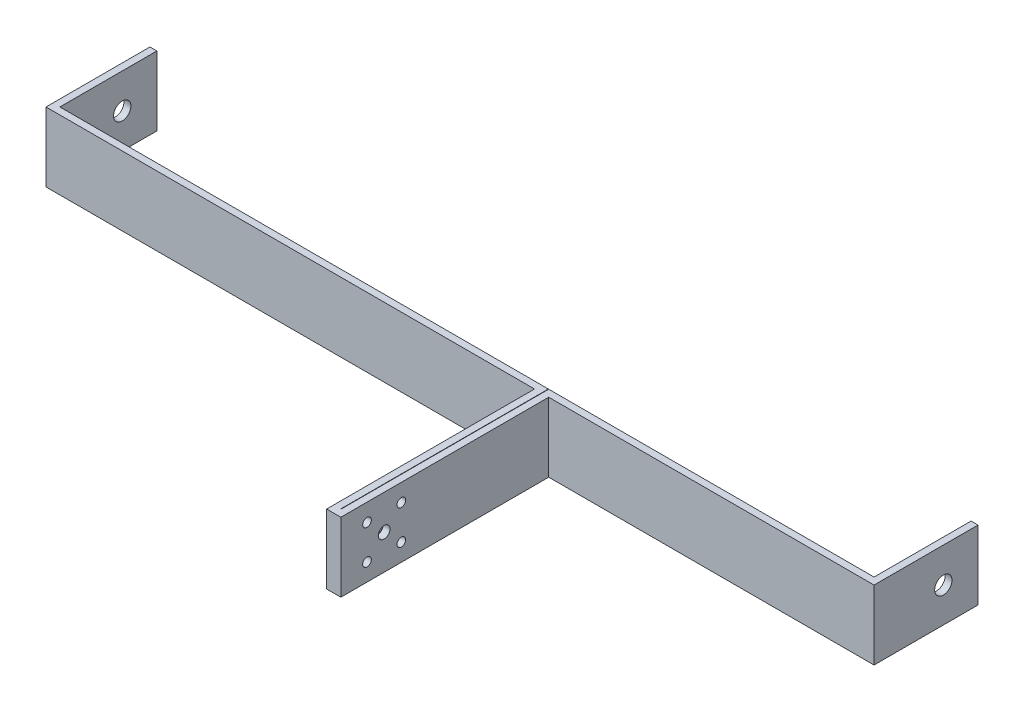
ISO-10303-21;
HEADER;
FILE_DESCRIPTION(('STEP AP214'),'2;1');
FILE_NAME('part.step','',(''),(''),'','','');
FILE_SCHEMA(('AUTOMOTIVE_DESIGN { 1 0 10303 214 1 1 1 1 }'));
ENDSEC;
DATA;
#1=APPLICATION_CONTEXT('core data for automotive mechanical design processes');
#2=APPLICATION_PROTOCOL_DEFINITION('international standard','automotive_design',2000,#1);
#3=PRODUCT_CONTEXT('',#1,'mechanical');
#4=PRODUCT('Part','Part','',(#3));
#5=PRODUCT_RELATED_PRODUCT_CATEGORY('part','',(#4));
#6=PRODUCT_DEFINITION_FORMATION('','',#4);
#7=PRODUCT_DEFINITION_CONTEXT('part definition',#1,'design');
#8=PRODUCT_DEFINITION('design','',#6,#7);
#9=PRODUCT_DEFINITION_SHAPE('','',#8);
#10=(LENGTH_UNIT() NAMED_UNIT(*) SI_UNIT(.MILLI.,.METRE.));
#11=(NAMED_UNIT(*) PLANE_ANGLE_UNIT() SI_UNIT($,.RADIAN.));
#12=(NAMED_UNIT(*) SI_UNIT($,.STERADIAN.) SOLID_ANGLE_UNIT());
#13=UNCERTAINTY_MEASURE_WITH_UNIT(LENGTH_MEASURE(1.E-05),#10,'distance_accuracy_value','');
#14=(GEOMETRIC_REPRESENTATION_CONTEXT(3) GLOBAL_UNCERTAINTY_ASSIGNED_CONTEXT((#13)) GLOBAL_UNIT_ASSIGNED_CONTEXT((#10,
#11,#12)) REPRESENTATION_CONTEXT('',''));
#15=CARTESIAN_POINT('',(0.,0.,0.));
#16=DIRECTION('',(0.,0.,1.));
#17=DIRECTION('',(1.,0.,0.));
#18=AXIS2_PLACEMENT_3D('',#15,#16,#17);
#19=CARTESIAN_POINT('',(0.,-10.,18.));
#20=DIRECTION('',(0.,0.,1.));
#21=DIRECTION('',(1.,0.,0.));
#22=AXIS2_PLACEMENT_3D('',#19,#20,#21);
#23=PLANE('',#22);
#24=DIRECTION('',(0.,1.,0.));
#25=VECTOR('',#24,1.);
#26=CARTESIAN_POINT('',(23.6,-10.,18.));
#27=LINE('',#26,#25);
#28=CARTESIAN_POINT('',(23.6,-10.,18.));
#29=VERTEX_POINT('',#28);
#30=CARTESIAN_POINT('',(23.6,10.,18.));
#31=VERTEX_POINT('',#30);
#32=EDGE_CURVE('E151',#29,#31,#27,.T.);
#33=ORIENTED_EDGE('',*,*,#32,.T.);
#34=DIRECTION('',(1.,0.,0.));
#35=VECTOR('',#34,1.);
#36=CARTESIAN_POINT('',(0.,10.,18.));
#37=LINE('',#36,#35);
#38=CARTESIAN_POINT('',(117.5,10.,18.));
#39=VERTEX_POINT('',#38);
#40=EDGE_CURVE('E154',#31,#39,#37,.T.);
#41=ORIENTED_EDGE('',*,*,#40,.T.);
#42=DIRECTION('',(0.,1.,0.));
#43=VECTOR('',#42,1.);
#44=CARTESIAN_POINT('',(117.5,-10.,18.));
#45=LINE('',#44,#43);
#46=CARTESIAN_POINT('',(117.5,-10.,18.));
#47=VERTEX_POINT('',#46);
#48=EDGE_CURVE('E11',#47,#39,#45,.T.);
#49=ORIENTED_EDGE('',*,*,#48,.F.);
#50=DIRECTION('',(1.,0.,0.));
#51=VECTOR('',#50,1.);
#52=CARTESIAN_POINT('',(0.,-10.,18.));
#53=LINE('',#52,#51);
#54=EDGE_CURVE('E156',#29,#47,#53,.T.);
#55=ORIENTED_EDGE('',*,*,#54,.F.);
#56=EDGE_LOOP('',(#33,#41,#49,#55));
#57=FACE_BOUND('',#56,.T.);
#58=ADVANCED_FACE('F40',(#57),#23,.F.);
#59=CARTESIAN_POINT('',(117.5,-10.,0.));
#60=DIRECTION('',(1.,0.,0.));
#61=DIRECTION('',(0.,0.,-1.));
#62=AXIS2_PLACEMENT_3D('',#59,#60,#61);
#63=PLANE('',#62);
#64=CARTESIAN_POINT('',(117.5,0.,0.));
#65=DIRECTION('',(1.,0.,0.));
#66=DIRECTION('',(0.,0.,-1.));
#67=AXIS2_PLACEMENT_3D('',#64,#65,#66);
#68=CIRCLE('',#67,2.5);
#69=CARTESIAN_POINT('',(117.5,0.,-2.5));
#70=VERTEX_POINT('',#69);
#71=EDGE_CURVE('E171',#70,#70,#68,.T.);
#72=ORIENTED_EDGE('',*,*,#71,.T.);
#73=EDGE_LOOP('',(#72));
#74=FACE_BOUND('',#73,.T.);
#75=ORIENTED_EDGE('',*,*,#48,.T.);
#76=DIRECTION('',(0.,0.,-1.));
#77=VECTOR('',#76,1.);
#78=CARTESIAN_POINT('',(117.5,10.,0.));
#79=LINE('',#78,#77);
#80=CARTESIAN_POINT('',(117.5,10.,-10.));
#81=VERTEX_POINT('',#80);
#82=EDGE_CURVE('E170',#39,#81,#79,.T.);
#83=ORIENTED_EDGE('',*,*,#82,.T.);
#84=DIRECTION('',(0.,1.,0.));
#85=VECTOR('',#84,1.);
#86=CARTESIAN_POINT('',(117.5,-10.,-10.));
#87=LINE('',#86,#85);
#88=CARTESIAN_POINT('',(117.5,-10.,-10.));
#89=VERTEX_POINT('',#88);
#90=EDGE_CURVE('E48',#89,#81,#87,.T.);
#91=ORIENTED_EDGE('',*,*,#90,.F.);
#92=DIRECTION('',(0.,0.,-1.));
#93=VECTOR('',#92,1.);
#94=CARTESIAN_POINT('',(117.5,-10.,0.));
#95=LINE('',#94,#93);
#96=EDGE_CURVE('E55',#47,#89,#95,.T.);
#97=ORIENTED_EDGE('',*,*,#96,.F.);
#98=EDGE_LOOP('',(#75,#83,#91,#97));
#99=FACE_BOUND('',#98,.T.);
#100=ADVANCED_FACE('F331',(#74,#99),#63,.F.);
#101=CARTESIAN_POINT('',(0.,-10.,-10.0000000000001));
#102=DIRECTION('',(0.,0.,1.));
#103=DIRECTION('',(1.,0.,0.));
#104=AXIS2_PLACEMENT_3D('',#101,#102,#103);
#105=PLANE('',#104);
#106=ORIENTED_EDGE('',*,*,#90,.T.);
#107=DIRECTION('',(1.,0.,0.));
#108=VECTOR('',#107,1.);
#109=CARTESIAN_POINT('',(0.,10.,-10.0000000000001));
#110=LINE('',#109,#108);
#111=CARTESIAN_POINT('',(119.5,10.,-10.));
#112=VERTEX_POINT('',#111);
#113=EDGE_CURVE('E213',#81,#112,#110,.T.);
#114=ORIENTED_EDGE('',*,*,#113,.T.);
#115=DIRECTION('',(0.,1.,0.));
#116=VECTOR('',#115,1.);
#117=CARTESIAN_POINT('',(119.5,-10.,-10.));
#118=LINE('',#117,#116);
#119=CARTESIAN_POINT('',(119.5,-10.,-10.));
#120=VERTEX_POINT('',#119);
#121=EDGE_CURVE('E256',#120,#112,#118,.T.);
#122=ORIENTED_EDGE('',*,*,#121,.F.);
#123=DIRECTION('',(1.,0.,0.));
#124=VECTOR('',#123,1.);
#125=CARTESIAN_POINT('',(0.,-10.,-10.0000000000001));
#126=LINE('',#125,#124);
#127=EDGE_CURVE('E252',#89,#120,#126,.T.);
#128=ORIENTED_EDGE('',*,*,#127,.F.);
#129=EDGE_LOOP('',(#106,#114,#122,#128));
#130=FACE_BOUND('',#129,.T.);
#131=ADVANCED_FACE('F354',(#130),#105,.F.);
#132=CARTESIAN_POINT('',(119.5,-10.,0.));
#133=DIRECTION('',(-1.,0.,0.));
#134=DIRECTION('',(0.,0.,1.));
#135=AXIS2_PLACEMENT_3D('',#132,#133,#134);
#136=PLANE('',#135);
#137=CARTESIAN_POINT('',(119.5,0.,0.));
#138=DIRECTION('',(-1.,0.,0.));
#139=DIRECTION('',(0.,0.,1.));
#140=AXIS2_PLACEMENT_3D('',#137,#138,#139);
#141=CIRCLE('',#140,2.5);
#142=CARTESIAN_POINT('',(119.5,0.,2.5));
#143=VERTEX_POINT('',#142);
#144=EDGE_CURVE('E284',#143,#143,#141,.T.);
#145=ORIENTED_EDGE('',*,*,#144,.T.);
#146=EDGE_LOOP('',(#145));
#147=FACE_BOUND('',#146,.T.);
#148=ORIENTED_EDGE('',*,*,#121,.T.);
#149=DIRECTION('',(0.,0.,1.));
#150=VECTOR('',#149,1.);
#151=CARTESIAN_POINT('',(119.5,10.,0.));
#152=LINE('',#151,#150);
#153=CARTESIAN_POINT('',(119.5,10.,20.));
#154=VERTEX_POINT('',#153);
#155=EDGE_CURVE('E210',#112,#154,#152,.T.);
#156=ORIENTED_EDGE('',*,*,#155,.T.);
#157=DIRECTION('',(0.,1.,0.));
#158=VECTOR('',#157,1.);
#159=CARTESIAN_POINT('',(119.5,-10.,20.));
#160=LINE('',#159,#158);
#161=CARTESIAN_POINT('',(119.5,-10.,20.));
#162=VERTEX_POINT('',#161);
#163=EDGE_CURVE('E258',#162,#154,#160,.T.);
#164=ORIENTED_EDGE('',*,*,#163,.F.);
#165=DIRECTION('',(0.,0.,1.));
#166=VECTOR('',#165,1.);
#167=CARTESIAN_POINT('',(119.5,-10.,0.));
#168=LINE('',#167,#166);
#169=EDGE_CURVE('E250',#120,#162,#168,.T.);
#170=ORIENTED_EDGE('',*,*,#169,.F.);
#171=EDGE_LOOP('',(#148,#156,#164,#170));
#172=FACE_BOUND('',#171,.T.);
#173=ADVANCED_FACE('F359',(#147,#172),#136,.F.);
#174=CARTESIAN_POINT('',(0.,-10.,20.));
#175=DIRECTION('',(0.,0.,1.));
#176=DIRECTION('',(1.,0.,0.));
#177=AXIS2_PLACEMENT_3D('',#174,#175,#176);
#178=PLANE('',#177);
#179=ORIENTED_EDGE('',*,*,#163,.T.);
#180=DIRECTION('',(1.,0.,0.));
#181=VECTOR('',#180,1.);
#182=CARTESIAN_POINT('',(0.,10.,20.));
#183=LINE('',#182,#181);
#184=CARTESIAN_POINT('',(25.6,10.,20.));
#185=VERTEX_POINT('',#184);
#186=EDGE_CURVE('E207',#185,#154,#183,.T.);
#187=ORIENTED_EDGE('',*,*,#186,.F.);
#188=DIRECTION('',(0.,1.,0.));
#189=VECTOR('',#188,1.);
#190=CARTESIAN_POINT('',(25.6,-10.,20.));
#191=LINE('',#190,#189);
#192=CARTESIAN_POINT('',(25.6,-10.,20.));
#193=VERTEX_POINT('',#192);
#194=EDGE_CURVE('E260',#193,#185,#191,.T.);
#195=ORIENTED_EDGE('',*,*,#194,.F.);
#196=DIRECTION('',(1.,0.,0.));
#197=VECTOR('',#196,1.);
#198=CARTESIAN_POINT('',(0.,-10.,20.));
#199=LINE('',#198,#197);
#200=EDGE_CURVE('E247',#193,#162,#199,.T.);
#201=ORIENTED_EDGE('',*,*,#200,.T.);
#202=EDGE_LOOP('',(#179,#187,#195,#201));
#203=FACE_BOUND('',#202,.T.);
#204=ADVANCED_FACE('F367',(#203),#178,.T.);
#205=CARTESIAN_POINT('',(25.6,-10.,0.));
#206=DIRECTION('',(1.,0.,0.));
#207=DIRECTION('',(0.,0.,-1.));
#208=AXIS2_PLACEMENT_3D('',#205,#206,#207);
#209=PLANE('',#208);
#210=CARTESIAN_POINT('',(25.6,-4.94974746830583,62.5502525316942));
#211=DIRECTION('',(1.,0.,0.));
#212=DIRECTION('',(0.,0.,-1.));
#213=AXIS2_PLACEMENT_3D('',#210,#211,#212);
#214=CIRCLE('',#213,1.25);
#215=CARTESIAN_POINT('',(25.6,-4.94974746830583,61.3002525316942));
#216=VERTEX_POINT('',#215);
#217=EDGE_CURVE('E463',#216,#216,#214,.T.);
#218=ORIENTED_EDGE('',*,*,#217,.F.);
#219=EDGE_LOOP('',(#218));
#220=FACE_BOUND('',#219,.T.);
#221=CARTESIAN_POINT('',(25.6,4.94974746830583,62.5502525316942));
#222=DIRECTION('',(1.,0.,0.));
#223=DIRECTION('',(0.,0.,-1.));
#224=AXIS2_PLACEMENT_3D('',#221,#222,#223);
#225=CIRCLE('',#224,1.25);
#226=CARTESIAN_POINT('',(25.6,4.94974746830583,61.3002525316942));
#227=VERTEX_POINT('',#226);
#228=EDGE_CURVE('E466',#227,#227,#225,.T.);
#229=ORIENTED_EDGE('',*,*,#228,.F.);
#230=EDGE_LOOP('',(#229));
#231=FACE_BOUND('',#230,.T.);
#232=CARTESIAN_POINT('',(25.6,4.94974746830583,72.4497474683058));
#233=DIRECTION('',(1.,0.,0.));
#234=DIRECTION('',(0.,0.,-1.));
#235=AXIS2_PLACEMENT_3D('',#232,#233,#234);
#236=CIRCLE('',#235,1.25);
#237=CARTESIAN_POINT('',(25.6,4.94974746830583,71.1997474683058));
#238=VERTEX_POINT('',#237);
#239=EDGE_CURVE('E469',#238,#238,#236,.T.);
#240=ORIENTED_EDGE('',*,*,#239,.F.);
#241=EDGE_LOOP('',(#240));
#242=FACE_BOUND('',#241,.T.);
#243=CARTESIAN_POINT('',(25.6,-4.94974746830583,72.4497474683058));
#244=DIRECTION('',(1.,0.,0.));
#245=DIRECTION('',(0.,0.,-1.));
#246=AXIS2_PLACEMENT_3D('',#243,#244,#245);
#247=CIRCLE('',#246,1.25);
#248=CARTESIAN_POINT('',(25.6,-4.94974746830583,71.1997474683058));
#249=VERTEX_POINT('',#248);
#250=EDGE_CURVE('E462',#249,#249,#247,.T.);
#251=ORIENTED_EDGE('',*,*,#250,.F.);
#252=EDGE_LOOP('',(#251));
#253=FACE_BOUND('',#252,.T.);
#254=CARTESIAN_POINT('',(25.6,0.,67.5));
#255=DIRECTION('',(1.,0.,0.));
#256=DIRECTION('',(0.,0.,-1.));
#257=AXIS2_PLACEMENT_3D('',#254,#255,#256);
#258=CIRCLE('',#257,1.7);
#259=CARTESIAN_POINT('',(25.6,0.,65.8));
#260=VERTEX_POINT('',#259);
#261=EDGE_CURVE('E290',#260,#260,#258,.T.);
#262=ORIENTED_EDGE('',*,*,#261,.F.);
#263=EDGE_LOOP('',(#262));
#264=FACE_BOUND('',#263,.T.);
#265=ORIENTED_EDGE('',*,*,#194,.T.);
#266=DIRECTION('',(0.,0.,-1.));
#267=VECTOR('',#266,1.);
#268=CARTESIAN_POINT('',(25.6,10.,0.));
#269=LINE('',#268,#267);
#270=CARTESIAN_POINT('',(25.6,10.,80.));
#271=VERTEX_POINT('',#270);
#272=EDGE_CURVE('E204',#271,#185,#269,.T.);
#273=ORIENTED_EDGE('',*,*,#272,.F.);
#274=DIRECTION('',(0.,1.,0.));
#275=VECTOR('',#274,1.);
#276=CARTESIAN_POINT('',(25.6,-10.,80.));
#277=LINE('',#276,#275);
#278=CARTESIAN_POINT('',(25.6,-10.,80.));
#279=VERTEX_POINT('',#278);
#280=EDGE_CURVE('E262',#279,#271,#277,.T.);
#281=ORIENTED_EDGE('',*,*,#280,.F.);
#282=DIRECTION('',(0.,0.,-1.));
#283=VECTOR('',#282,1.);
#284=CARTESIAN_POINT('',(25.6,-10.,0.));
#285=LINE('',#284,#283);
#286=EDGE_CURVE('E244',#279,#193,#285,.T.);
#287=ORIENTED_EDGE('',*,*,#286,.T.);
#288=EDGE_LOOP('',(#265,#273,#281,#287));
#289=FACE_BOUND('',#288,.T.);
#290=ADVANCED_FACE('F371',(#220,#231,#242,#253,#264,#289),#209,.T.);
#291=CARTESIAN_POINT('',(0.,-10.,80.));
#292=DIRECTION('',(0.,0.,1.));
#293=DIRECTION('',(1.,0.,0.));
#294=AXIS2_PLACEMENT_3D('',#291,#292,#293);
#295=PLANE('',#294);
#296=ORIENTED_EDGE('',*,*,#280,.T.);
#297=DIRECTION('',(1.,0.,0.));
#298=VECTOR('',#297,1.);
#299=CARTESIAN_POINT('',(0.,10.,80.));
#300=LINE('',#299,#298);
#301=CARTESIAN_POINT('',(21.5,10.,80.));
#302=VERTEX_POINT('',#301);
#303=EDGE_CURVE('E201',#302,#271,#300,.T.);
#304=ORIENTED_EDGE('',*,*,#303,.F.);
#305=DIRECTION('',(0.,1.,0.));
#306=VECTOR('',#305,1.);
#307=CARTESIAN_POINT('',(21.5,-10.,80.));
#308=LINE('',#307,#306);
#309=CARTESIAN_POINT('',(21.5,-10.,80.));
#310=VERTEX_POINT('',#309);
#311=EDGE_CURVE('E264',#310,#302,#308,.T.);
#312=ORIENTED_EDGE('',*,*,#311,.F.);
#313=DIRECTION('',(1.,0.,0.));
#314=VECTOR('',#313,1.);
#315=CARTESIAN_POINT('',(0.,-10.,80.));
#316=LINE('',#315,#314);
#317=EDGE_CURVE('E241',#310,#279,#316,.T.);
#318=ORIENTED_EDGE('',*,*,#317,.T.);
#319=EDGE_LOOP('',(#296,#304,#312,#318));
#320=FACE_BOUND('',#319,.T.);
#321=ADVANCED_FACE('F375',(#320),#295,.T.);
#322=CARTESIAN_POINT('',(21.5,-10.,0.));
#323=DIRECTION('',(-1.,0.,0.));
#324=DIRECTION('',(0.,0.,1.));
#325=AXIS2_PLACEMENT_3D('',#322,#323,#324);
#326=PLANE('',#325);
#327=CARTESIAN_POINT('',(21.5,-4.94974746830583,62.5502525316942));
#328=DIRECTION('',(-1.,0.,0.));
#329=DIRECTION('',(0.,0.,1.));
#330=AXIS2_PLACEMENT_3D('',#327,#328,#329);
#331=CIRCLE('',#330,1.25);
#332=CARTESIAN_POINT('',(21.5,-4.94974746830583,63.8002525316942));
#333=VERTEX_POINT('',#332);
#334=EDGE_CURVE('E322',#333,#333,#331,.T.);
#335=ORIENTED_EDGE('',*,*,#334,.F.);
#336=EDGE_LOOP('',(#335));
#337=FACE_BOUND('',#336,.T.);
#338=CARTESIAN_POINT('',(21.5,4.94974746830583,62.5502525316942));
#339=DIRECTION('',(-1.,0.,0.));
#340=DIRECTION('',(0.,0.,1.));
#341=AXIS2_PLACEMENT_3D('',#338,#339,#340);
#342=CIRCLE('',#341,1.25);
#343=CARTESIAN_POINT('',(21.5,4.94974746830583,63.8002525316942));
#344=VERTEX_POINT('',#343);
#345=EDGE_CURVE('E307',#344,#344,#342,.T.);
#346=ORIENTED_EDGE('',*,*,#345,.F.);
#347=EDGE_LOOP('',(#346));
#348=FACE_BOUND('',#347,.T.);
#349=CARTESIAN_POINT('',(21.5,4.94974746830583,72.4497474683058));
#350=DIRECTION('',(-1.,0.,0.));
#351=DIRECTION('',(0.,0.,1.));
#352=AXIS2_PLACEMENT_3D('',#349,#350,#351);
#353=CIRCLE('',#352,1.25);
#354=CARTESIAN_POINT('',(21.5,4.94974746830583,73.6997474683058));
#355=VERTEX_POINT('',#354);
#356=EDGE_CURVE('E303',#355,#355,#353,.T.);
#357=ORIENTED_EDGE('',*,*,#356,.F.);
#358=EDGE_LOOP('',(#357));
#359=FACE_BOUND('',#358,.T.);
#360=CARTESIAN_POINT('',(21.5,-4.94974746830583,72.4497474683058));
#361=DIRECTION('',(-1.,0.,0.));
#362=DIRECTION('',(0.,0.,1.));
#363=AXIS2_PLACEMENT_3D('',#360,#361,#362);
#364=CIRCLE('',#363,1.25);
#365=CARTESIAN_POINT('',(21.5,-4.94974746830583,73.6997474683058));
#366=VERTEX_POINT('',#365);
#367=EDGE_CURVE('E299',#366,#366,#364,.T.);
#368=ORIENTED_EDGE('',*,*,#367,.F.);
#369=EDGE_LOOP('',(#368));
#370=FACE_BOUND('',#369,.T.);
#371=CARTESIAN_POINT('',(21.5,0.,67.5));
#372=DIRECTION('',(-1.,0.,0.));
#373=DIRECTION('',(0.,0.,1.));
#374=AXIS2_PLACEMENT_3D('',#371,#372,#373);
#375=CIRCLE('',#374,1.7);
#376=CARTESIAN_POINT('',(21.5,0.,69.2));
#377=VERTEX_POINT('',#376);
#378=EDGE_CURVE('E295',#377,#377,#375,.T.);
#379=ORIENTED_EDGE('',*,*,#378,.F.);
#380=EDGE_LOOP('',(#379));
#381=FACE_BOUND('',#380,.T.);
#382=ORIENTED_EDGE('',*,*,#311,.T.);
#383=DIRECTION('',(0.,0.,1.));
#384=VECTOR('',#383,1.);
#385=CARTESIAN_POINT('',(21.5,10.,0.));
#386=LINE('',#385,#384);
#387=CARTESIAN_POINT('',(21.5,10.,20.));
#388=VERTEX_POINT('',#387);
#389=EDGE_CURVE('E198',#388,#302,#386,.T.);
#390=ORIENTED_EDGE('',*,*,#389,.F.);
#391=DIRECTION('',(0.,1.,0.));
#392=VECTOR('',#391,1.);
#393=CARTESIAN_POINT('',(21.5,-10.,20.));
#394=LINE('',#393,#392);
#395=CARTESIAN_POINT('',(21.5,-10.,20.));
#396=VERTEX_POINT('',#395);
#397=EDGE_CURVE('E266',#396,#388,#394,.T.);
#398=ORIENTED_EDGE('',*,*,#397,.F.);
#399=DIRECTION('',(0.,0.,1.));
#400=VECTOR('',#399,1.);
#401=CARTESIAN_POINT('',(21.5,-10.,0.));
#402=LINE('',#401,#400);
#403=EDGE_CURVE('E238',#396,#310,#402,.T.);
#404=ORIENTED_EDGE('',*,*,#403,.T.);
#405=EDGE_LOOP('',(#382,#390,#398,#404));
#406=FACE_BOUND('',#405,.T.);
#407=ADVANCED_FACE('F379',(#337,#348,#359,#370,#381,#406),#326,.T.);
#408=CARTESIAN_POINT('',(0.,-10.,20.));
#409=DIRECTION('',(0.,0.,1.));
#410=DIRECTION('',(1.,0.,0.));
#411=AXIS2_PLACEMENT_3D('',#408,#409,#410);
#412=PLANE('',#411);
#413=ORIENTED_EDGE('',*,*,#397,.T.);
#414=DIRECTION('',(1.,0.,0.));
#415=VECTOR('',#414,1.);
#416=CARTESIAN_POINT('',(0.,10.,20.));
#417=LINE('',#416,#415);
#418=CARTESIAN_POINT('',(-119.5,10.,20.));
#419=VERTEX_POINT('',#418);
#420=EDGE_CURVE('E195',#419,#388,#417,.T.);
#421=ORIENTED_EDGE('',*,*,#420,.F.);
#422=DIRECTION('',(0.,1.,0.));
#423=VECTOR('',#422,1.);
#424=CARTESIAN_POINT('',(-119.5,-10.,20.));
#425=LINE('',#424,#423);
#426=CARTESIAN_POINT('',(-119.5,-10.,20.));
#427=VERTEX_POINT('',#426);
#428=EDGE_CURVE('E268',#427,#419,#425,.T.);
#429=ORIENTED_EDGE('',*,*,#428,.F.);
#430=DIRECTION('',(1.,0.,0.));
#431=VECTOR('',#430,1.);
#432=CARTESIAN_POINT('',(0.,-10.,20.));
#433=LINE('',#432,#431);
#434=EDGE_CURVE('E235',#427,#396,#433,.T.);
#435=ORIENTED_EDGE('',*,*,#434,.T.);
#436=EDGE_LOOP('',(#413,#421,#429,#435));
#437=FACE_BOUND('',#436,.T.);
#438=ADVANCED_FACE('F383',(#437),#412,.T.);
#439=CARTESIAN_POINT('',(-119.5,-10.,0.));
#440=DIRECTION('',(-1.,0.,0.));
#441=DIRECTION('',(0.,0.,1.));
#442=AXIS2_PLACEMENT_3D('',#439,#440,#441);
#443=PLANE('',#442);
#444=CARTESIAN_POINT('',(-119.5,0.,0.));
#445=DIRECTION('',(-1.,0.,0.));
#446=DIRECTION('',(0.,0.,1.));
#447=AXIS2_PLACEMENT_3D('',#444,#445,#446);
#448=CIRCLE('',#447,2.5);
#449=CARTESIAN_POINT('',(-119.5,0.,2.5));
#450=VERTEX_POINT('',#449);
#451=EDGE_CURVE('E285',#450,#450,#448,.T.);
#452=ORIENTED_EDGE('',*,*,#451,.F.);
#453=EDGE_LOOP('',(#452));
#454=FACE_BOUND('',#453,.T.);
#455=ORIENTED_EDGE('',*,*,#428,.T.);
#456=DIRECTION('',(0.,0.,1.));
#457=VECTOR('',#456,1.);
#458=CARTESIAN_POINT('',(-119.5,10.,0.));
#459=LINE('',#458,#457);
#460=CARTESIAN_POINT('',(-119.5,10.,-10.));
#461=VERTEX_POINT('',#460);
#462=EDGE_CURVE('E192',#461,#419,#459,.T.);
#463=ORIENTED_EDGE('',*,*,#462,.F.);
#464=DIRECTION('',(0.,1.,0.));
#465=VECTOR('',#464,1.);
#466=CARTESIAN_POINT('',(-119.5,-10.,-10.));
#467=LINE('',#466,#465);
#468=CARTESIAN_POINT('',(-119.5,-10.,-10.));
#469=VERTEX_POINT('',#468);
#470=EDGE_CURVE('E270',#469,#461,#467,.T.);
#471=ORIENTED_EDGE('',*,*,#470,.F.);
#472=DIRECTION('',(0.,0.,1.));
#473=VECTOR('',#472,1.);
#474=CARTESIAN_POINT('',(-119.5,-10.,0.));
#475=LINE('',#474,#473);
#476=EDGE_CURVE('E232',#469,#427,#475,.T.);
#477=ORIENTED_EDGE('',*,*,#476,.T.);
#478=EDGE_LOOP('',(#455,#463,#471,#477));
#479=FACE_BOUND('',#478,.T.);
#480=ADVANCED_FACE('F387',(#454,#479),#443,.T.);
#481=CARTESIAN_POINT('',(0.,-10.,-10.0000000000001));
#482=DIRECTION('',(0.,0.,-1.));
#483=DIRECTION('',(-1.,0.,0.));
#484=AXIS2_PLACEMENT_3D('',#481,#482,#483);
#485=PLANE('',#484);
#486=ORIENTED_EDGE('',*,*,#470,.T.);
#487=DIRECTION('',(-1.,0.,0.));
#488=VECTOR('',#487,1.);
#489=CARTESIAN_POINT('',(0.,10.,-10.0000000000001));
#490=LINE('',#489,#488);
#491=CARTESIAN_POINT('',(-117.5,10.,-10.));
#492=VERTEX_POINT('',#491);
#493=EDGE_CURVE('E189',#492,#461,#490,.T.);
#494=ORIENTED_EDGE('',*,*,#493,.F.);
#495=DIRECTION('',(0.,1.,0.));
#496=VECTOR('',#495,1.);
#497=CARTESIAN_POINT('',(-117.5,-10.,-10.));
#498=LINE('',#497,#496);
#499=CARTESIAN_POINT('',(-117.5,-10.,-10.));
#500=VERTEX_POINT('',#499);
#501=EDGE_CURVE('E272',#500,#492,#498,.T.);
#502=ORIENTED_EDGE('',*,*,#501,.F.);
#503=DIRECTION('',(-1.,0.,0.));
#504=VECTOR('',#503,1.);
#505=CARTESIAN_POINT('',(0.,-10.,-10.0000000000001));
#506=LINE('',#505,#504);
#507=EDGE_CURVE('E229',#500,#469,#506,.T.);
#508=ORIENTED_EDGE('',*,*,#507,.T.);
#509=EDGE_LOOP('',(#486,#494,#502,#508));
#510=FACE_BOUND('',#509,.T.);
#511=ADVANCED_FACE('F391',(#510),#485,.T.);
#512=CARTESIAN_POINT('',(-117.5,-10.,0.));
#513=DIRECTION('',(1.,0.,0.));
#514=DIRECTION('',(0.,0.,-1.));
#515=AXIS2_PLACEMENT_3D('',#512,#513,#514);
#516=PLANE('',#515);
#517=CARTESIAN_POINT('',(-117.5,0.,0.));
#518=DIRECTION('',(1.,0.,0.));
#519=DIRECTION('',(0.,0.,-1.));
#520=AXIS2_PLACEMENT_3D('',#517,#518,#519);
#521=CIRCLE('',#520,2.5);
#522=CARTESIAN_POINT('',(-117.5,0.,-2.5));
#523=VERTEX_POINT('',#522);
#524=EDGE_CURVE('E281',#523,#523,#521,.T.);
#525=ORIENTED_EDGE('',*,*,#524,.F.);
#526=EDGE_LOOP('',(#525));
#527=FACE_BOUND('',#526,.T.);
#528=ORIENTED_EDGE('',*,*,#501,.T.);
#529=DIRECTION('',(0.,0.,-1.));
#530=VECTOR('',#529,1.);
#531=CARTESIAN_POINT('',(-117.5,10.,0.));
#532=LINE('',#531,#530);
#533=CARTESIAN_POINT('',(-117.5,10.,18.));
#534=VERTEX_POINT('',#533);
#535=EDGE_CURVE('E186',#534,#492,#532,.T.);
#536=ORIENTED_EDGE('',*,*,#535,.F.);
#537=DIRECTION('',(0.,1.,0.));
#538=VECTOR('',#537,1.);
#539=CARTESIAN_POINT('',(-117.5,-10.,18.));
#540=LINE('',#539,#538);
#541=CARTESIAN_POINT('',(-117.5,-10.,18.));
#542=VERTEX_POINT('',#541);
#543=EDGE_CURVE('E274',#542,#534,#540,.T.);
#544=ORIENTED_EDGE('',*,*,#543,.F.);
#545=DIRECTION('',(0.,0.,-1.));
#546=VECTOR('',#545,1.);
#547=CARTESIAN_POINT('',(-117.5,-10.,0.));
#548=LINE('',#547,#546);
#549=EDGE_CURVE('E226',#542,#500,#548,.T.);
#550=ORIENTED_EDGE('',*,*,#549,.T.);
#551=EDGE_LOOP('',(#528,#536,#544,#550));
#552=FACE_BOUND('',#551,.T.);
#553=ADVANCED_FACE('F395',(#527,#552),#516,.T.);
#554=CARTESIAN_POINT('',(0.,-10.,18.));
#555=DIRECTION('',(0.,0.,1.));
#556=DIRECTION('',(1.,0.,0.));
#557=AXIS2_PLACEMENT_3D('',#554,#555,#556);
#558=PLANE('',#557);
#559=ORIENTED_EDGE('',*,*,#543,.T.);
#560=DIRECTION('',(1.,0.,0.));
#561=VECTOR('',#560,1.);
#562=CARTESIAN_POINT('',(0.,10.,18.));
#563=LINE('',#562,#561);
#564=CARTESIAN_POINT('',(23.5,10.,18.));
#565=VERTEX_POINT('',#564);
#566=EDGE_CURVE('E183',#534,#565,#563,.T.);
#567=ORIENTED_EDGE('',*,*,#566,.T.);
#568=DIRECTION('',(0.,1.,0.));
#569=VECTOR('',#568,1.);
#570=CARTESIAN_POINT('',(23.5,-10.,18.));
#571=LINE('',#570,#569);
#572=CARTESIAN_POINT('',(23.5,-10.,18.));
#573=VERTEX_POINT('',#572);
#574=EDGE_CURVE('E276',#573,#565,#571,.T.);
#575=ORIENTED_EDGE('',*,*,#574,.F.);
#576=DIRECTION('',(1.,0.,0.));
#577=VECTOR('',#576,1.);
#578=CARTESIAN_POINT('',(0.,-10.,18.));
#579=LINE('',#578,#577);
#580=EDGE_CURVE('E224',#542,#573,#579,.T.);
#581=ORIENTED_EDGE('',*,*,#580,.F.);
#582=EDGE_LOOP('',(#559,#567,#575,#581));
#583=FACE_BOUND('',#582,.T.);
#584=ADVANCED_FACE('F399',(#583),#558,.F.);
#585=CARTESIAN_POINT('',(23.5,-10.,0.));
#586=DIRECTION('',(-1.,0.,0.));
#587=DIRECTION('',(0.,0.,1.));
#588=AXIS2_PLACEMENT_3D('',#585,#586,#587);
#589=PLANE('',#588);
#590=CARTESIAN_POINT('',(23.5,-4.94974746830583,62.5502525316942));
#591=DIRECTION('',(-1.,0.,0.));
#592=DIRECTION('',(0.,0.,1.));
#593=AXIS2_PLACEMENT_3D('',#590,#591,#592);
#594=CIRCLE('',#593,1.25);
#595=CARTESIAN_POINT('',(23.5,-4.94974746830583,63.8002525316942));
#596=VERTEX_POINT('',#595);
#597=EDGE_CURVE('E319',#596,#596,#594,.T.);
#598=ORIENTED_EDGE('',*,*,#597,.T.);
#599=EDGE_LOOP('',(#598));
#600=FACE_BOUND('',#599,.T.);
#601=CARTESIAN_POINT('',(23.5,4.94974746830583,62.5502525316942));
#602=DIRECTION('',(-1.,0.,0.));
#603=DIRECTION('',(0.,0.,1.));
#604=AXIS2_PLACEMENT_3D('',#601,#602,#603);
#605=CIRCLE('',#604,1.25);
#606=CARTESIAN_POINT('',(23.5,4.94974746830583,63.8002525316942));
#607=VERTEX_POINT('',#606);
#608=EDGE_CURVE('E302',#607,#607,#605,.T.);
#609=ORIENTED_EDGE('',*,*,#608,.T.);
#610=EDGE_LOOP('',(#609));
#611=FACE_BOUND('',#610,.T.);
#612=CARTESIAN_POINT('',(23.5,4.94974746830583,72.4497474683058));
#613=DIRECTION('',(-1.,0.,0.));
#614=DIRECTION('',(0.,0.,1.));
#615=AXIS2_PLACEMENT_3D('',#612,#613,#614);
#616=CIRCLE('',#615,1.25);
#617=CARTESIAN_POINT('',(23.5,4.94974746830583,73.6997474683058));
#618=VERTEX_POINT('',#617);
#619=EDGE_CURVE('E298',#618,#618,#616,.T.);
#620=ORIENTED_EDGE('',*,*,#619,.T.);
#621=EDGE_LOOP('',(#620));
#622=FACE_BOUND('',#621,.T.);
#623=CARTESIAN_POINT('',(23.5,-4.94974746830583,72.4497474683058));
#624=DIRECTION('',(-1.,0.,0.));
#625=DIRECTION('',(0.,0.,1.));
#626=AXIS2_PLACEMENT_3D('',#623,#624,#625);
#627=CIRCLE('',#626,1.25);
#628=CARTESIAN_POINT('',(23.5,-4.94974746830583,73.6997474683058));
#629=VERTEX_POINT('',#628);
#630=EDGE_CURVE('E294',#629,#629,#627,.T.);
#631=ORIENTED_EDGE('',*,*,#630,.T.);
#632=EDGE_LOOP('',(#631));
#633=FACE_BOUND('',#632,.T.);
#634=CARTESIAN_POINT('',(23.5,0.,67.5));
#635=DIRECTION('',(-1.,0.,0.));
#636=DIRECTION('',(0.,0.,1.));
#637=AXIS2_PLACEMENT_3D('',#634,#635,#636);
#638=CIRCLE('',#637,1.7);
#639=CARTESIAN_POINT('',(23.5,0.,69.2));
#640=VERTEX_POINT('',#639);
#641=EDGE_CURVE('E289',#640,#640,#638,.T.);
#642=ORIENTED_EDGE('',*,*,#641,.T.);
#643=EDGE_LOOP('',(#642));
#644=FACE_BOUND('',#643,.T.);
#645=ORIENTED_EDGE('',*,*,#574,.T.);
#646=DIRECTION('',(0.,0.,1.));
#647=VECTOR('',#646,1.);
#648=CARTESIAN_POINT('',(23.5,10.,0.));
#649=LINE('',#648,#647);
#650=CARTESIAN_POINT('',(23.5,10.,78.));
#651=VERTEX_POINT('',#650);
#652=EDGE_CURVE('E177',#565,#651,#649,.T.);
#653=ORIENTED_EDGE('',*,*,#652,.T.);
#654=DIRECTION('',(0.,1.,0.));
#655=VECTOR('',#654,1.);
#656=CARTESIAN_POINT('',(23.5,-10.,78.));
#657=LINE('',#656,#655);
#658=CARTESIAN_POINT('',(23.5,-10.,78.));
#659=VERTEX_POINT('',#658);
#660=EDGE_CURVE('E278',#659,#651,#657,.T.);
#661=ORIENTED_EDGE('',*,*,#660,.F.);
#662=DIRECTION('',(0.,0.,1.));
#663=VECTOR('',#662,1.);
#664=CARTESIAN_POINT('',(23.5,-10.,0.));
#665=LINE('',#664,#663);
#666=EDGE_CURVE('E222',#573,#659,#665,.T.);
#667=ORIENTED_EDGE('',*,*,#666,.F.);
#668=EDGE_LOOP('',(#645,#653,#661,#667));
#669=FACE_BOUND('',#668,.T.);
#670=ADVANCED_FACE('F403',(#600,#611,#622,#633,#644,#669),#589,.F.);
#671=CARTESIAN_POINT('',(0.,-10.,78.));
#672=DIRECTION('',(0.,0.,1.));
#673=DIRECTION('',(1.,0.,0.));
#674=AXIS2_PLACEMENT_3D('',#671,#672,#673);
#675=PLANE('',#674);
#676=ORIENTED_EDGE('',*,*,#660,.T.);
#677=DIRECTION('',(1.,0.,0.));
#678=VECTOR('',#677,1.);
#679=CARTESIAN_POINT('',(0.,10.,78.));
#680=LINE('',#679,#678);
#681=CARTESIAN_POINT('',(23.6,10.,78.));
#682=VERTEX_POINT('',#681);
#683=EDGE_CURVE('E175',#651,#682,#680,.T.);
#684=ORIENTED_EDGE('',*,*,#683,.T.);
#685=DIRECTION('',(0.,1.,0.));
#686=VECTOR('',#685,1.);
#687=CARTESIAN_POINT('',(23.6,-10.,78.));
#688=LINE('',#687,#686);
#689=CARTESIAN_POINT('',(23.6,-10.,78.));
#690=VERTEX_POINT('',#689);
#691=EDGE_CURVE('E160',#690,#682,#688,.T.);
#692=ORIENTED_EDGE('',*,*,#691,.F.);
#693=DIRECTION('',(1.,0.,0.));
#694=VECTOR('',#693,1.);
#695=CARTESIAN_POINT('',(0.,-10.,78.));
#696=LINE('',#695,#694);
#697=EDGE_CURVE('E220',#659,#690,#696,.T.);
#698=ORIENTED_EDGE('',*,*,#697,.F.);
#699=EDGE_LOOP('',(#676,#684,#692,#698));
#700=FACE_BOUND('',#699,.T.);
#701=ADVANCED_FACE('F407',(#700),#675,.F.);
#702=CARTESIAN_POINT('',(23.6,-10.,0.));
#703=DIRECTION('',(1.,0.,0.));
#704=DIRECTION('',(0.,0.,-1.));
#705=AXIS2_PLACEMENT_3D('',#702,#703,#704);
#706=PLANE('',#705);
#707=CARTESIAN_POINT('',(23.6,-4.94974746830583,62.5502525316942));
#708=DIRECTION('',(1.,0.,0.));
#709=DIRECTION('',(0.,0.,-1.));
#710=AXIS2_PLACEMENT_3D('',#707,#708,#709);
#711=CIRCLE('',#710,1.25);
#712=CARTESIAN_POINT('',(23.6,-4.94974746830583,61.3002525316942));
#713=VERTEX_POINT('',#712);
#714=EDGE_CURVE('E43',#713,#713,#711,.T.);
#715=ORIENTED_EDGE('',*,*,#714,.T.);
#716=EDGE_LOOP('',(#715));
#717=FACE_BOUND('',#716,.T.);
#718=CARTESIAN_POINT('',(23.6,4.94974746830583,62.5502525316942));
#719=DIRECTION('',(1.,0.,0.));
#720=DIRECTION('',(0.,0.,-1.));
#721=AXIS2_PLACEMENT_3D('',#718,#719,#720);
#722=CIRCLE('',#721,1.25);
#723=CARTESIAN_POINT('',(23.6,4.94974746830583,61.3002525316942));
#724=VERTEX_POINT('',#723);
#725=EDGE_CURVE('E300',#724,#724,#722,.T.);
#726=ORIENTED_EDGE('',*,*,#725,.T.);
#727=EDGE_LOOP('',(#726));
#728=FACE_BOUND('',#727,.T.);
#729=CARTESIAN_POINT('',(23.6,4.94974746830583,72.4497474683058));
#730=DIRECTION('',(1.,0.,0.));
#731=DIRECTION('',(0.,0.,-1.));
#732=AXIS2_PLACEMENT_3D('',#729,#730,#731);
#733=CIRCLE('',#732,1.25);
#734=CARTESIAN_POINT('',(23.6,4.94974746830583,71.1997474683058));
#735=VERTEX_POINT('',#734);
#736=EDGE_CURVE('E296',#735,#735,#733,.T.);
#737=ORIENTED_EDGE('',*,*,#736,.T.);
#738=EDGE_LOOP('',(#737));
#739=FACE_BOUND('',#738,.T.);
#740=CARTESIAN_POINT('',(23.6,-4.94974746830583,72.4497474683058));
#741=DIRECTION('',(1.,0.,0.));
#742=DIRECTION('',(0.,0.,-1.));
#743=AXIS2_PLACEMENT_3D('',#740,#741,#742);
#744=CIRCLE('',#743,1.25);
#745=CARTESIAN_POINT('',(23.6,-4.94974746830583,71.1997474683058));
#746=VERTEX_POINT('',#745);
#747=EDGE_CURVE('E291',#746,#746,#744,.T.);
#748=ORIENTED_EDGE('',*,*,#747,.T.);
#749=EDGE_LOOP('',(#748));
#750=FACE_BOUND('',#749,.T.);
#751=CARTESIAN_POINT('',(23.6,0.,67.5));
#752=DIRECTION('',(1.,0.,0.));
#753=DIRECTION('',(0.,0.,-1.));
#754=AXIS2_PLACEMENT_3D('',#751,#752,#753);
#755=CIRCLE('',#754,1.7);
#756=CARTESIAN_POINT('',(23.6,0.,65.8));
#757=VERTEX_POINT('',#756);
#758=EDGE_CURVE('E286',#757,#757,#755,.T.);
#759=ORIENTED_EDGE('',*,*,#758,.T.);
#760=EDGE_LOOP('',(#759));
#761=FACE_BOUND('',#760,.T.);
#762=ORIENTED_EDGE('',*,*,#691,.T.);
#763=DIRECTION('',(0.,0.,-1.));
#764=VECTOR('',#763,1.);
#765=CARTESIAN_POINT('',(23.6,10.,0.));
#766=LINE('',#765,#764);
#767=EDGE_CURVE('E166',#682,#31,#766,.T.);
#768=ORIENTED_EDGE('',*,*,#767,.T.);
#769=ORIENTED_EDGE('',*,*,#32,.F.);
#770=DIRECTION('',(0.,0.,-1.));
#771=VECTOR('',#770,1.);
#772=CARTESIAN_POINT('',(23.6,-10.,0.));
#773=LINE('',#772,#771);
#774=EDGE_CURVE('E218',#690,#29,#773,.T.);
#775=ORIENTED_EDGE('',*,*,#774,.F.);
#776=EDGE_LOOP('',(#762,#768,#769,#775));
#777=FACE_BOUND('',#776,.T.);
#778=ADVANCED_FACE('F173',(#717,#728,#739,#750,#761,#777),#706,.F.);
#779=CARTESIAN_POINT('',(0.,-10.,0.));
#780=DIRECTION('',(0.,1.,0.));
#781=DIRECTION('',(0.,0.,1.));
#782=AXIS2_PLACEMENT_3D('',#779,#780,#781);
#783=PLANE('',#782);
#784=ORIENTED_EDGE('',*,*,#54,.T.);
#785=ORIENTED_EDGE('',*,*,#96,.T.);
#786=ORIENTED_EDGE('',*,*,#127,.T.);
#787=ORIENTED_EDGE('',*,*,#169,.T.);
#788=ORIENTED_EDGE('',*,*,#200,.F.);
#789=ORIENTED_EDGE('',*,*,#286,.F.);
#790=ORIENTED_EDGE('',*,*,#317,.F.);
#791=ORIENTED_EDGE('',*,*,#403,.F.);
#792=ORIENTED_EDGE('',*,*,#434,.F.);
#793=ORIENTED_EDGE('',*,*,#476,.F.);
#794=ORIENTED_EDGE('',*,*,#507,.F.);
#795=ORIENTED_EDGE('',*,*,#549,.F.);
#796=ORIENTED_EDGE('',*,*,#580,.T.);
#797=ORIENTED_EDGE('',*,*,#666,.T.);
#798=ORIENTED_EDGE('',*,*,#697,.T.);
#799=ORIENTED_EDGE('',*,*,#774,.T.);
#800=EDGE_LOOP('',(#784,#785,#786,#787,#788,#789,#790,#791,#792,#793,#794,#795,#796,#797,#798,#799));
#801=FACE_BOUND('',#800,.T.);
#802=ADVANCED_FACE('F363',(#801),#783,.F.);
#803=CARTESIAN_POINT('',(0.,10.,0.));
#804=DIRECTION('',(0.,1.,0.));
#805=DIRECTION('',(0.,0.,1.));
#806=AXIS2_PLACEMENT_3D('',#803,#804,#805);
#807=PLANE('',#806);
#808=ORIENTED_EDGE('',*,*,#40,.F.);
#809=ORIENTED_EDGE('',*,*,#767,.F.);
#810=ORIENTED_EDGE('',*,*,#683,.F.);
#811=ORIENTED_EDGE('',*,*,#652,.F.);
#812=ORIENTED_EDGE('',*,*,#566,.F.);
#813=ORIENTED_EDGE('',*,*,#535,.T.);
#814=ORIENTED_EDGE('',*,*,#493,.T.);
#815=ORIENTED_EDGE('',*,*,#462,.T.);
#816=ORIENTED_EDGE('',*,*,#420,.T.);
#817=ORIENTED_EDGE('',*,*,#389,.T.);
#818=ORIENTED_EDGE('',*,*,#303,.T.);
#819=ORIENTED_EDGE('',*,*,#272,.T.);
#820=ORIENTED_EDGE('',*,*,#186,.T.);
#821=ORIENTED_EDGE('',*,*,#155,.F.);
#822=ORIENTED_EDGE('',*,*,#113,.F.);
#823=ORIENTED_EDGE('',*,*,#82,.F.);
#824=EDGE_LOOP('',(#808,#809,#810,#811,#812,#813,#814,#815,#816,#817,#818,#819,#820,#821,#822,#823));
#825=FACE_BOUND('',#824,.T.);
#826=ADVANCED_FACE('F164',(#825),#807,.T.);
#827=CARTESIAN_POINT('',(165.5,0.,0.));
#828=DIRECTION('',(-1.,0.,0.));
#829=DIRECTION('',(0.,0.,1.));
#830=AXIS2_PLACEMENT_3D('',#827,#828,#829);
#831=CYLINDRICAL_SURFACE('',#830,2.5);
#832=ORIENTED_EDGE('',*,*,#524,.T.);
#833=EDGE_LOOP('',(#832));
#834=FACE_BOUND('',#833,.T.);
#835=ORIENTED_EDGE('',*,*,#451,.T.);
#836=EDGE_LOOP('',(#835));
#837=FACE_BOUND('',#836,.T.);
#838=ADVANCED_FACE('F336',(#834,#837),#831,.F.);
#839=ORIENTED_EDGE('',*,*,#144,.F.);
#840=EDGE_LOOP('',(#839));
#841=FACE_BOUND('',#840,.T.);
#842=ORIENTED_EDGE('',*,*,#71,.F.);
#843=EDGE_LOOP('',(#842));
#844=FACE_BOUND('',#843,.T.);
#845=ADVANCED_FACE('F333',(#841,#844),#831,.F.);
#846=CARTESIAN_POINT('',(-259.4,0.,67.5));
#847=DIRECTION('',(1.,0.,0.));
#848=DIRECTION('',(0.,0.,-1.));
#849=AXIS2_PLACEMENT_3D('',#846,#847,#848);
#850=CYLINDRICAL_SURFACE('',#849,1.7);
#851=ORIENTED_EDGE('',*,*,#261,.T.);
#852=EDGE_LOOP('',(#851));
#853=FACE_BOUND('',#852,.T.);
#854=ORIENTED_EDGE('',*,*,#758,.F.);
#855=EDGE_LOOP('',(#854));
#856=FACE_BOUND('',#855,.T.);
#857=ADVANCED_FACE('F335',(#853,#856),#850,.F.);
#858=CARTESIAN_POINT('',(-259.4,-4.94974746830583,72.4497474683058));
#859=DIRECTION('',(1.,0.,0.));
#860=DIRECTION('',(0.,0.,-1.));
#861=AXIS2_PLACEMENT_3D('',#858,#859,#860);
#862=CYLINDRICAL_SURFACE('',#861,1.25);
#863=ORIENTED_EDGE('',*,*,#250,.T.);
#864=EDGE_LOOP('',(#863));
#865=FACE_BOUND('',#864,.T.);
#866=ORIENTED_EDGE('',*,*,#747,.F.);
#867=EDGE_LOOP('',(#866));
#868=FACE_BOUND('',#867,.T.);
#869=ADVANCED_FACE('F343',(#865,#868),#862,.F.);
#870=CARTESIAN_POINT('',(-259.4,4.94974746830583,72.4497474683058));
#871=DIRECTION('',(1.,0.,0.));
#872=DIRECTION('',(0.,0.,-1.));
#873=AXIS2_PLACEMENT_3D('',#870,#871,#872);
#874=CYLINDRICAL_SURFACE('',#873,1.25);
#875=ORIENTED_EDGE('',*,*,#239,.T.);
#876=EDGE_LOOP('',(#875));
#877=FACE_BOUND('',#876,.T.);
#878=ORIENTED_EDGE('',*,*,#736,.F.);
#879=EDGE_LOOP('',(#878));
#880=FACE_BOUND('',#879,.T.);
#881=ADVANCED_FACE('F427',(#877,#880),#874,.F.);
#882=CARTESIAN_POINT('',(-259.4,4.94974746830583,62.5502525316942));
#883=DIRECTION('',(1.,0.,0.));
#884=DIRECTION('',(0.,0.,-1.));
#885=AXIS2_PLACEMENT_3D('',#882,#883,#884);
#886=CYLINDRICAL_SURFACE('',#885,1.25);
#887=ORIENTED_EDGE('',*,*,#228,.T.);
#888=EDGE_LOOP('',(#887));
#889=FACE_BOUND('',#888,.T.);
#890=ORIENTED_EDGE('',*,*,#725,.F.);
#891=EDGE_LOOP('',(#890));
#892=FACE_BOUND('',#891,.T.);
#893=ADVANCED_FACE('F434',(#889,#892),#886,.F.);
#894=CARTESIAN_POINT('',(-259.4,-4.94974746830583,62.5502525316941));
#895=DIRECTION('',(1.,0.,0.));
#896=DIRECTION('',(0.,0.,-1.));
#897=AXIS2_PLACEMENT_3D('',#894,#895,#896);
#898=CYLINDRICAL_SURFACE('',#897,1.25);
#899=ORIENTED_EDGE('',*,*,#217,.T.);
#900=EDGE_LOOP('',(#899));
#901=FACE_BOUND('',#900,.T.);
#902=ORIENTED_EDGE('',*,*,#714,.F.);
#903=EDGE_LOOP('',(#902));
#904=FACE_BOUND('',#903,.T.);
#905=ADVANCED_FACE('F446',(#901,#904),#898,.F.);
#906=ORIENTED_EDGE('',*,*,#378,.T.);
#907=EDGE_LOOP('',(#906));
#908=FACE_BOUND('',#907,.T.);
#909=ORIENTED_EDGE('',*,*,#641,.F.);
#910=EDGE_LOOP('',(#909));
#911=FACE_BOUND('',#910,.T.);
#912=ADVANCED_FACE('F346',(#908,#911),#850,.F.);
#913=ORIENTED_EDGE('',*,*,#367,.T.);
#914=EDGE_LOOP('',(#913));
#915=FACE_BOUND('',#914,.T.);
#916=ORIENTED_EDGE('',*,*,#630,.F.);
#917=EDGE_LOOP('',(#916));
#918=FACE_BOUND('',#917,.T.);
#919=ADVANCED_FACE('F430',(#915,#918),#862,.F.);
#920=ORIENTED_EDGE('',*,*,#356,.T.);
#921=EDGE_LOOP('',(#920));
#922=FACE_BOUND('',#921,.T.);
#923=ORIENTED_EDGE('',*,*,#619,.F.);
#924=EDGE_LOOP('',(#923));
#925=FACE_BOUND('',#924,.T.);
#926=ADVANCED_FACE('F437',(#922,#925),#874,.F.);
#927=ORIENTED_EDGE('',*,*,#345,.T.);
#928=EDGE_LOOP('',(#927));
#929=FACE_BOUND('',#928,.T.);
#930=ORIENTED_EDGE('',*,*,#608,.F.);
#931=EDGE_LOOP('',(#930));
#932=FACE_BOUND('',#931,.T.);
#933=ADVANCED_FACE('F445',(#929,#932),#886,.F.);
#934=ORIENTED_EDGE('',*,*,#334,.T.);
#935=EDGE_LOOP('',(#934));
#936=FACE_BOUND('',#935,.T.);
#937=ORIENTED_EDGE('',*,*,#597,.F.);
#938=EDGE_LOOP('',(#937));
#939=FACE_BOUND('',#938,.T.);
#940=ADVANCED_FACE('F524',(#936,#939),#898,.F.);
#941=CLOSED_SHELL('',(#58,#100,#131,#173,#204,#290,#321,#407,#438,#480,#511,#553,#584,#670,#701,
#778,#802,#826,#838,#845,#857,#869,#881,#893,#905,#912,#919,#926,#933,#940));
#942=MANIFOLD_SOLID_BREP('B2',#941);
#943=ADVANCED_BREP_SHAPE_REPRESENTATION('',(#18,#942),#14);
#944=SHAPE_DEFINITION_REPRESENTATION(#9,#943);
ENDSEC;
END-ISO-10303-21;
